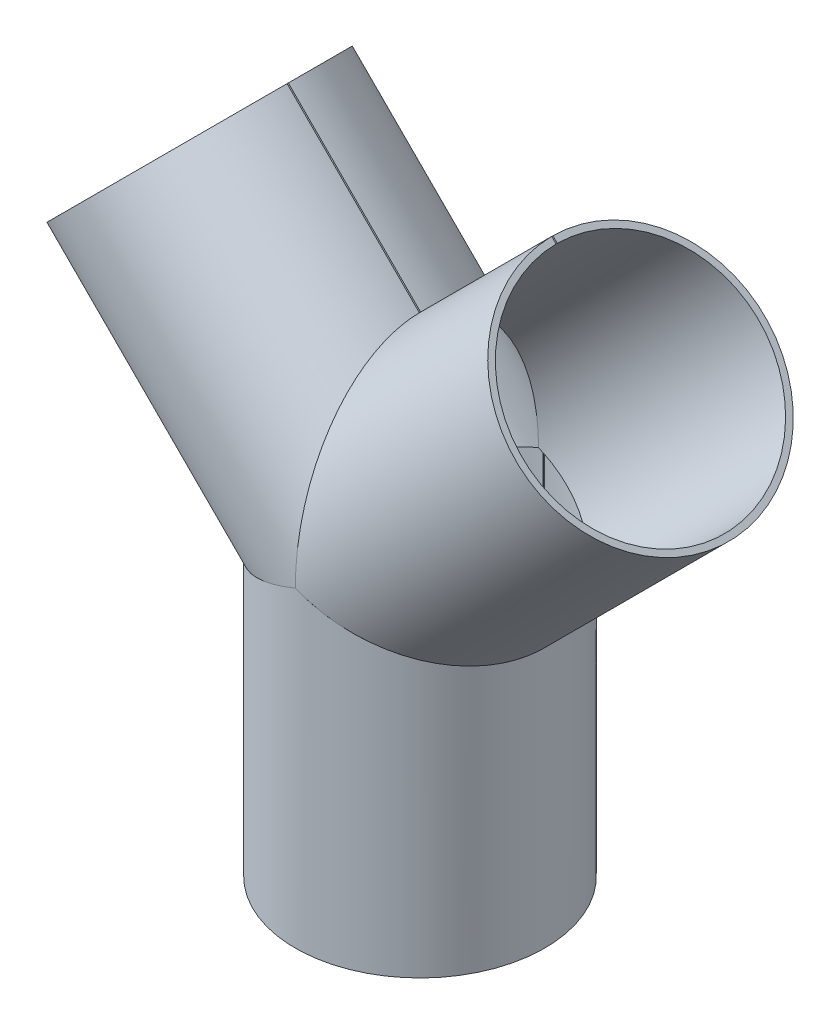
ISO-10303-21;
HEADER;
FILE_DESCRIPTION(('STEP AP214'),'2;1');
FILE_NAME('part.step','',(''),(''),'','','');
FILE_SCHEMA(('AUTOMOTIVE_DESIGN { 1 0 10303 214 1 1 1 1 }'));
ENDSEC;
DATA;
#1=APPLICATION_CONTEXT('core data for automotive mechanical design processes');
#2=APPLICATION_PROTOCOL_DEFINITION('international standard','automotive_design',2000,#1);
#3=PRODUCT_CONTEXT('',#1,'mechanical');
#4=PRODUCT('Part','Part','',(#3));
#5=PRODUCT_RELATED_PRODUCT_CATEGORY('part','',(#4));
#6=PRODUCT_DEFINITION_FORMATION('','',#4);
#7=PRODUCT_DEFINITION_CONTEXT('part definition',#1,'design');
#8=PRODUCT_DEFINITION('design','',#6,#7);
#9=PRODUCT_DEFINITION_SHAPE('','',#8);
#10=(LENGTH_UNIT() NAMED_UNIT(*) SI_UNIT(.MILLI.,.METRE.));
#11=(NAMED_UNIT(*) PLANE_ANGLE_UNIT() SI_UNIT($,.RADIAN.));
#12=(NAMED_UNIT(*) SI_UNIT($,.STERADIAN.) SOLID_ANGLE_UNIT());
#13=UNCERTAINTY_MEASURE_WITH_UNIT(LENGTH_MEASURE(1.E-05),#10,'distance_accuracy_value','');
#14=(GEOMETRIC_REPRESENTATION_CONTEXT(3) GLOBAL_UNCERTAINTY_ASSIGNED_CONTEXT((#13)) GLOBAL_UNIT_ASSIGNED_CONTEXT((#10,
#11,#12)) REPRESENTATION_CONTEXT('',''));
#15=CARTESIAN_POINT('',(0.,0.,0.));
#16=DIRECTION('',(0.,0.,1.));
#17=DIRECTION('',(1.,0.,0.));
#18=AXIS2_PLACEMENT_3D('',#15,#16,#17);
#19=CARTESIAN_POINT('',(0.,0.,0.));
#20=DIRECTION('',(0.,-1.,0.));
#21=DIRECTION('',(1.,0.,0.));
#22=AXIS2_PLACEMENT_3D('',#19,#20,#21);
#23=CYLINDRICAL_SURFACE('',#22,200.);
#24=CARTESIAN_POINT('',(0.,0.,0.));
#25=DIRECTION('',(-0.382683432365084,-0.923879532511289,0.));
#26=DIRECTION('',(0.923879532511289,-0.382683432365084,0.));
#27=AXIS2_PLACEMENT_3D('',#24,#25,#26);
#28=ELLIPSE('',#27,216.478440058478,200.);
#29=CARTESIAN_POINT('',(0.999996874994865,-0.414212267953578,-199.9975));
#30=VERTEX_POINT('',#29);
#31=CARTESIAN_POINT('',(0.,0.,200.));
#32=VERTEX_POINT('',#31);
#33=EDGE_CURVE('E130',#30,#32,#28,.T.);
#34=ORIENTED_EDGE('',*,*,#33,.T.);
#35=CARTESIAN_POINT('',(0.,0.,0.));
#36=DIRECTION('',(0.382683432365084,-0.923879532511289,0.));
#37=DIRECTION('',(-0.923879532511289,-0.382683432365084,0.));
#38=AXIS2_PLACEMENT_3D('',#35,#36,#37);
#39=ELLIPSE('',#38,216.478440058478,200.);
#40=CARTESIAN_POINT('',(-0.999996874995147,-0.414212267953695,-199.9975));
#41=VERTEX_POINT('',#40);
#42=EDGE_CURVE('E133',#32,#41,#39,.T.);
#43=ORIENTED_EDGE('',*,*,#42,.T.);
#44=DIRECTION('',(0.,-1.,0.));
#45=VECTOR('',#44,1.);
#46=CARTESIAN_POINT('',(-0.999996874995147,0.,-199.9975));
#47=LINE('',#46,#45);
#48=CARTESIAN_POINT('',(-0.999996874995055,-500.,-199.9975));
#49=VERTEX_POINT('',#48);
#50=EDGE_CURVE('E97',#41,#49,#47,.T.);
#51=ORIENTED_EDGE('',*,*,#50,.T.);
#52=CARTESIAN_POINT('',(0.,-500.,0.));
#53=DIRECTION('',(0.,1.,0.));
#54=DIRECTION('',(-1.,0.,0.));
#55=AXIS2_PLACEMENT_3D('',#52,#53,#54);
#56=CIRCLE('',#55,200.);
#57=CARTESIAN_POINT('',(0.999996874994957,-500.,-199.9975));
#58=VERTEX_POINT('',#57);
#59=EDGE_CURVE('E146',#49,#58,#56,.T.);
#60=ORIENTED_EDGE('',*,*,#59,.T.);
#61=DIRECTION('',(0.,-1.,0.));
#62=VECTOR('',#61,1.);
#63=CARTESIAN_POINT('',(0.999996874994865,0.,-199.9975));
#64=LINE('',#63,#62);
#65=EDGE_CURVE('E90',#30,#58,#64,.T.);
#66=ORIENTED_EDGE('',*,*,#65,.F.);
#67=EDGE_LOOP('',(#34,#43,#51,#60,#66));
#68=FACE_BOUND('',#67,.T.);
#69=ADVANCED_FACE('F83',(#68),#23,.T.);
#70=CARTESIAN_POINT('',(0.992496898432423,0.,-198.49751875));
#71=DIRECTION('',(-0.9999875,0.,-0.00499998437496119));
#72=DIRECTION('',(-0.00499998437496119,0.,0.9999875));
#73=AXIS2_PLACEMENT_3D('',#70,#71,#72);
#74=PLANE('',#73);
#75=DIRECTION('',(-0.00499997365179152,0.00207105689808014,0.999985355386171));
#76=VECTOR('',#75,1.);
#77=CARTESIAN_POINT('',(0.992492641338627,-0.411103912597948,-198.496667339223));
#78=LINE('',#77,#76);
#79=CARTESIAN_POINT('',(0.992496898432423,-0.411105675943934,-198.49751875));
#80=VERTEX_POINT('',#79);
#81=EDGE_CURVE('E138',#30,#80,#78,.T.);
#82=ORIENTED_EDGE('',*,*,#81,.F.);
#83=ORIENTED_EDGE('',*,*,#65,.T.);
#84=DIRECTION('',(0.00499998437496119,0.,-0.9999875));
#85=VECTOR('',#84,1.);
#86=CARTESIAN_POINT('',(0.992496898432515,-500.,-198.49751875));
#87=LINE('',#86,#85);
#88=CARTESIAN_POINT('',(0.992496898432515,-500.,-198.49751875));
#89=VERTEX_POINT('',#88);
#90=EDGE_CURVE('E149',#89,#58,#87,.T.);
#91=ORIENTED_EDGE('',*,*,#90,.F.);
#92=DIRECTION('',(0.,-1.,0.));
#93=VECTOR('',#92,1.);
#94=CARTESIAN_POINT('',(0.992496898432423,0.,-198.49751875));
#95=LINE('',#94,#93);
#96=EDGE_CURVE('E164',#80,#89,#95,.T.);
#97=ORIENTED_EDGE('',*,*,#96,.F.);
#98=EDGE_LOOP('',(#82,#83,#91,#97));
#99=FACE_BOUND('',#98,.T.);
#100=ADVANCED_FACE('F167',(#99),#74,.T.);
#101=CARTESIAN_POINT('',(0.,0.,0.));
#102=DIRECTION('',(0.,-1.,0.));
#103=DIRECTION('',(1.,0.,0.));
#104=AXIS2_PLACEMENT_3D('',#101,#102,#103);
#105=CYLINDRICAL_SURFACE('',#104,198.5);
#106=CARTESIAN_POINT('',(0.,0.,0.));
#107=DIRECTION('',(-0.382683432365084,-0.923879532511289,0.));
#108=DIRECTION('',(0.923879532511289,-0.382683432365084,0.));
#109=AXIS2_PLACEMENT_3D('',#106,#107,#108);
#110=ELLIPSE('',#109,214.85485175804,198.5);
#111=CARTESIAN_POINT('',(0.,0.,198.5));
#112=VERTEX_POINT('',#111);
#113=EDGE_CURVE('E142',#80,#112,#110,.T.);
#114=ORIENTED_EDGE('',*,*,#113,.F.);
#115=ORIENTED_EDGE('',*,*,#96,.T.);
#116=CARTESIAN_POINT('',(0.,-500.,0.));
#117=DIRECTION('',(0.,1.,0.));
#118=DIRECTION('',(1.,0.,0.));
#119=AXIS2_PLACEMENT_3D('',#116,#117,#118);
#120=CIRCLE('',#119,198.5);
#121=CARTESIAN_POINT('',(-0.992496898432571,-500.,-198.49751875));
#122=VERTEX_POINT('',#121);
#123=EDGE_CURVE('E156',#122,#89,#120,.T.);
#124=ORIENTED_EDGE('',*,*,#123,.F.);
#125=DIRECTION('',(0.,-1.,0.));
#126=VECTOR('',#125,1.);
#127=CARTESIAN_POINT('',(-0.992496898432663,0.,-198.49751875));
#128=LINE('',#127,#126);
#129=CARTESIAN_POINT('',(-0.992496898432663,-0.411105675944034,-198.49751875));
#130=VERTEX_POINT('',#129);
#131=EDGE_CURVE('E105',#130,#122,#128,.T.);
#132=ORIENTED_EDGE('',*,*,#131,.F.);
#133=CARTESIAN_POINT('',(0.,0.,0.));
#134=DIRECTION('',(0.382683432365084,-0.923879532511289,0.));
#135=DIRECTION('',(-0.923879532511289,-0.382683432365084,0.));
#136=AXIS2_PLACEMENT_3D('',#133,#134,#135);
#137=ELLIPSE('',#136,214.85485175804,198.5);
#138=EDGE_CURVE('E147',#112,#130,#137,.T.);
#139=ORIENTED_EDGE('',*,*,#138,.F.);
#140=EDGE_LOOP('',(#114,#115,#124,#132,#139));
#141=FACE_BOUND('',#140,.T.);
#142=ADVANCED_FACE('F172',(#141),#105,.F.);
#143=CARTESIAN_POINT('',(-0.999996874995147,0.,-199.9975));
#144=DIRECTION('',(0.9999875,0.,-0.0049999843749888));
#145=DIRECTION('',(-0.0049999843749888,0.,-0.9999875));
#146=AXIS2_PLACEMENT_3D('',#143,#144,#145);
#147=PLANE('',#146);
#148=DIRECTION('',(-0.00499997365181913,-0.00207105689809158,-0.999985355386171));
#149=VECTOR('',#148,1.);
#150=CARTESIAN_POINT('',(-0.999992585731875,-0.414210491282676,-199.996642155388));
#151=LINE('',#150,#149);
#152=EDGE_CURVE('E137',#130,#41,#151,.T.);
#153=ORIENTED_EDGE('',*,*,#152,.F.);
#154=ORIENTED_EDGE('',*,*,#131,.T.);
#155=DIRECTION('',(0.0049999843749888,0.,0.9999875));
#156=VECTOR('',#155,1.);
#157=CARTESIAN_POINT('',(-0.999996874995055,-500.,-199.9975));
#158=LINE('',#157,#156);
#159=EDGE_CURVE('E159',#49,#122,#158,.T.);
#160=ORIENTED_EDGE('',*,*,#159,.F.);
#161=ORIENTED_EDGE('',*,*,#50,.F.);
#162=EDGE_LOOP('',(#153,#154,#160,#161));
#163=FACE_BOUND('',#162,.T.);
#164=ADVANCED_FACE('F175',(#163),#147,.T.);
#165=CARTESIAN_POINT('',(0.,-500.,0.));
#166=DIRECTION('',(0.,1.,0.));
#167=DIRECTION('',(1.,0.,0.));
#168=AXIS2_PLACEMENT_3D('',#165,#166,#167);
#169=PLANE('',#168);
#170=ORIENTED_EDGE('',*,*,#59,.F.);
#171=ORIENTED_EDGE('',*,*,#159,.T.);
#172=ORIENTED_EDGE('',*,*,#123,.T.);
#173=ORIENTED_EDGE('',*,*,#90,.T.);
#174=EDGE_LOOP('',(#170,#171,#172,#173));
#175=FACE_BOUND('',#174,.T.);
#176=ADVANCED_FACE('F170',(#175),#169,.F.);
#177=CARTESIAN_POINT('',(0.,0.,-200.));
#178=DIRECTION('',(0.382683432365084,-0.923879532511289,0.));
#179=DIRECTION('',(0.923879532511289,0.382683432365084,0.));
#180=AXIS2_PLACEMENT_3D('',#177,#178,#179);
#181=PLANE('',#180);
#182=DIRECTION('',(0.,0.,-1.));
#183=VECTOR('',#182,1.);
#184=CARTESIAN_POINT('',(0.,0.,0.));
#185=LINE('',#184,#183);
#186=EDGE_CURVE('E13',#32,#112,#185,.T.);
#187=ORIENTED_EDGE('',*,*,#186,.T.);
#188=ORIENTED_EDGE('',*,*,#138,.T.);
#189=ORIENTED_EDGE('',*,*,#152,.T.);
#190=ORIENTED_EDGE('',*,*,#42,.F.);
#191=EDGE_LOOP('',(#187,#188,#189,#190));
#192=FACE_BOUND('',#191,.T.);
#193=ADVANCED_FACE('F145',(#192),#181,.F.);
#194=CARTESIAN_POINT('',(0.,0.,-200.));
#195=DIRECTION('',(-0.382683432365084,-0.923879532511289,0.));
#196=DIRECTION('',(0.923879532511289,-0.382683432365084,0.));
#197=AXIS2_PLACEMENT_3D('',#194,#195,#196);
#198=PLANE('',#197);
#199=ORIENTED_EDGE('',*,*,#33,.F.);
#200=ORIENTED_EDGE('',*,*,#81,.T.);
#201=ORIENTED_EDGE('',*,*,#113,.T.);
#202=ORIENTED_EDGE('',*,*,#186,.F.);
#203=EDGE_LOOP('',(#199,#200,#201,#202));
#204=FACE_BOUND('',#203,.T.);
#205=ADVANCED_FACE('F140',(#204),#198,.F.);
#206=CLOSED_SHELL('',(#69,#100,#142,#164,#176,#193,#205));
#207=MANIFOLD_SOLID_BREP('B2',#206);
#208=CARTESIAN_POINT('',(-1.11022302462516E-13,0.,0.));
#209=DIRECTION('',(-0.707106781186549,0.707106781186546,0.));
#210=DIRECTION('',(-0.707106781186546,-0.707106781186549,0.));
#211=AXIS2_PLACEMENT_3D('',#208,#209,#210);
#212=CYLINDRICAL_SURFACE('',#211,200.);
#213=CARTESIAN_POINT('',(0.,0.,0.));
#214=DIRECTION('',(-1.,0.,0.));
#215=DIRECTION('',(0.,1.,0.));
#216=AXIS2_PLACEMENT_3D('',#213,#214,#215);
#217=ELLIPSE('',#216,282.842712474619,200.);
#218=CARTESIAN_POINT('',(0.,282.839176940713,0.9999968749952));
#219=VERTEX_POINT('',#218);
#220=CARTESIAN_POINT('',(0.,0.,200.));
#221=VERTEX_POINT('',#220);
#222=EDGE_CURVE('E321',#219,#221,#217,.F.);
#223=ORIENTED_EDGE('',*,*,#222,.F.);
#224=DIRECTION('',(-0.707106781186549,0.707106781186546,0.));
#225=VECTOR('',#224,1.);
#226=CARTESIAN_POINT('',(141.419588470356,141.419588470357,0.999996874995208));
#227=LINE('',#226,#225);
#228=CARTESIAN_POINT('',(-212.133802122918,494.97297906363,0.999996874995208));
#229=VERTEX_POINT('',#228);
#230=EDGE_CURVE('E336',#219,#229,#227,.T.);
#231=ORIENTED_EDGE('',*,*,#230,.T.);
#232=CARTESIAN_POINT('',(-353.553390593275,353.553390593273,0.));
#233=DIRECTION('',(-0.707106781186549,0.707106781186546,0.));
#234=DIRECTION('',(-0.707106781186546,-0.707106781186549,0.));
#235=AXIS2_PLACEMENT_3D('',#232,#233,#234);
#236=CIRCLE('',#235,200.);
#237=CARTESIAN_POINT('',(-212.133802122918,494.97297906363,-0.99999687499507));
#238=VERTEX_POINT('',#237);
#239=EDGE_CURVE('E323',#238,#229,#236,.T.);
#240=ORIENTED_EDGE('',*,*,#239,.F.);
#241=DIRECTION('',(-0.707106781186549,0.707106781186546,0.));
#242=VECTOR('',#241,1.);
#243=CARTESIAN_POINT('',(141.419588470356,141.419588470357,-0.99999687499507));
#244=LINE('',#243,#242);
#245=CARTESIAN_POINT('',(0.,282.839176940713,-0.999996874995076));
#246=VERTEX_POINT('',#245);
#247=EDGE_CURVE('E258',#246,#238,#244,.T.);
#248=ORIENTED_EDGE('',*,*,#247,.F.);
#249=CARTESIAN_POINT('',(0.,0.,-200.));
#250=VERTEX_POINT('',#249);
#251=EDGE_CURVE('E307',#250,#246,#217,.F.);
#252=ORIENTED_EDGE('',*,*,#251,.F.);
#253=CARTESIAN_POINT('',(0.,0.,0.));
#254=DIRECTION('',(0.382683432365096,-0.923879532511284,0.));
#255=DIRECTION('',(-0.923879532511284,-0.382683432365096,0.));
#256=AXIS2_PLACEMENT_3D('',#253,#254,#255);
#257=ELLIPSE('',#256,216.478440058478,200.);
#258=EDGE_CURVE('E318',#250,#221,#257,.F.);
#259=ORIENTED_EDGE('',*,*,#258,.T.);
#260=EDGE_LOOP('',(#223,#231,#240,#248,#252,#259));
#261=FACE_BOUND('',#260,.T.);
#262=ADVANCED_FACE('F251',(#261),#212,.T.);
#263=CARTESIAN_POINT('',(0.,0.,0.));
#264=DIRECTION('',(-0.707106781186549,0.707106781186546,0.));
#265=DIRECTION('',(-0.707106781186546,-0.707106781186549,0.));
#266=AXIS2_PLACEMENT_3D('',#263,#264,#265);
#267=CYLINDRICAL_SURFACE('',#266,190.);
#268=DIRECTION('',(-0.707106781186549,0.707106781186546,0.));
#269=VECTOR('',#268,1.);
#270=CARTESIAN_POINT('',(134.348609046838,134.348609046839,0.949997031245436));
#271=LINE('',#270,#269);
#272=CARTESIAN_POINT('',(0.,268.697218093677,0.949997031245436));
#273=VERTEX_POINT('',#272);
#274=CARTESIAN_POINT('',(-219.204781546436,487.901999640112,0.949997031245436));
#275=VERTEX_POINT('',#274);
#276=EDGE_CURVE('E339',#273,#275,#271,.T.);
#277=ORIENTED_EDGE('',*,*,#276,.F.);
#278=CARTESIAN_POINT('',(0.,0.,0.));
#279=DIRECTION('',(-1.,0.,0.));
#280=DIRECTION('',(0.,1.,0.));
#281=AXIS2_PLACEMENT_3D('',#278,#279,#280);
#282=ELLIPSE('',#281,268.700576850888,190.);
#283=CARTESIAN_POINT('',(0.,0.,190.));
#284=VERTEX_POINT('',#283);
#285=EDGE_CURVE('E353',#273,#284,#282,.F.);
#286=ORIENTED_EDGE('',*,*,#285,.T.);
#287=CARTESIAN_POINT('',(0.,0.,0.));
#288=DIRECTION('',(0.382683432365096,-0.923879532511284,0.));
#289=DIRECTION('',(-0.923879532511284,-0.382683432365096,0.));
#290=AXIS2_PLACEMENT_3D('',#287,#288,#289);
#291=ELLIPSE('',#290,205.654518055554,190.);
#292=CARTESIAN_POINT('',(0.,0.,-190.));
#293=VERTEX_POINT('',#292);
#294=EDGE_CURVE('E313',#293,#284,#291,.F.);
#295=ORIENTED_EDGE('',*,*,#294,.F.);
#296=CARTESIAN_POINT('',(0.,268.697218093677,-0.949997031245328));
#297=VERTEX_POINT('',#296);
#298=EDGE_CURVE('E308',#293,#297,#282,.F.);
#299=ORIENTED_EDGE('',*,*,#298,.T.);
#300=DIRECTION('',(-0.707106781186549,0.707106781186546,0.));
#301=VECTOR('',#300,1.);
#302=CARTESIAN_POINT('',(134.348609046838,134.348609046839,-0.949997031245328));
#303=LINE('',#302,#301);
#304=CARTESIAN_POINT('',(-219.204781546436,487.901999640112,-0.949997031245328));
#305=VERTEX_POINT('',#304);
#306=EDGE_CURVE('E272',#297,#305,#303,.T.);
#307=ORIENTED_EDGE('',*,*,#306,.T.);
#308=CARTESIAN_POINT('',(-353.553390593274,353.553390593273,0.));
#309=DIRECTION('',(-0.707106781186549,0.707106781186546,0.));
#310=DIRECTION('',(0.,0.,1.));
#311=AXIS2_PLACEMENT_3D('',#308,#309,#310);
#312=CIRCLE('',#311,190.);
#313=EDGE_CURVE('E332',#305,#275,#312,.T.);
#314=ORIENTED_EDGE('',*,*,#313,.T.);
#315=EDGE_LOOP('',(#277,#286,#295,#299,#307,#314));
#316=FACE_BOUND('',#315,.T.);
#317=ADVANCED_FACE('F358',(#316),#267,.F.);
#318=CARTESIAN_POINT('',(141.419588470356,141.419588470357,-0.99999687499507));
#319=DIRECTION('',(-0.00353552285737103,-0.00353552285737104,-0.9999875));
#320=DIRECTION('',(0.,0.999993749941406,-0.00353554495445795));
#321=AXIS2_PLACEMENT_3D('',#318,#319,#320);
#322=PLANE('',#321);
#323=ORIENTED_EDGE('',*,*,#306,.F.);
#324=DIRECTION('',(0.,0.999993749941406,-0.00353554495445795));
#325=VECTOR('',#324,1.);
#326=CARTESIAN_POINT('',(0.,141.421356226261,-0.500004687517184));
#327=LINE('',#326,#325);
#328=EDGE_CURVE('E350',#297,#246,#327,.T.);
#329=ORIENTED_EDGE('',*,*,#328,.T.);
#330=ORIENTED_EDGE('',*,*,#247,.T.);
#331=DIRECTION('',(-0.707097942351781,-0.707097942351784,0.0049999843749742));
#332=VECTOR('',#331,1.);
#333=CARTESIAN_POINT('',(-212.133802122918,494.97297906363,-0.99999687499507));
#334=LINE('',#333,#332);
#335=EDGE_CURVE('E334',#238,#305,#334,.T.);
#336=ORIENTED_EDGE('',*,*,#335,.T.);
#337=EDGE_LOOP('',(#323,#329,#330,#336));
#338=FACE_BOUND('',#337,.T.);
#339=ADVANCED_FACE('F349',(#338),#322,.F.);
#340=CARTESIAN_POINT('',(134.348609046838,134.348609046839,0.949997031245436));
#341=DIRECTION('',(-0.00353552285737315,-0.00353552285737317,0.9999875));
#342=DIRECTION('',(0.,-0.999993749941406,-0.00353554495446008));
#343=AXIS2_PLACEMENT_3D('',#340,#341,#342);
#344=PLANE('',#343);
#345=ORIENTED_EDGE('',*,*,#230,.F.);
#346=DIRECTION('',(0.,-0.999993749941406,-0.00353554495446008));
#347=VECTOR('',#346,1.);
#348=CARTESIAN_POINT('',(0.,134.350288414948,0.475004453141158));
#349=LINE('',#348,#347);
#350=EDGE_CURVE('E356',#219,#273,#349,.T.);
#351=ORIENTED_EDGE('',*,*,#350,.T.);
#352=ORIENTED_EDGE('',*,*,#276,.T.);
#353=DIRECTION('',(0.707097942351781,0.707097942351784,0.0049999843749772));
#354=VECTOR('',#353,1.);
#355=CARTESIAN_POINT('',(-219.204781546436,487.901999640112,0.949997031245436));
#356=LINE('',#355,#354);
#357=EDGE_CURVE('E326',#275,#229,#356,.T.);
#358=ORIENTED_EDGE('',*,*,#357,.T.);
#359=EDGE_LOOP('',(#345,#351,#352,#358));
#360=FACE_BOUND('',#359,.T.);
#361=ADVANCED_FACE('F344',(#360),#344,.F.);
#362=CARTESIAN_POINT('',(-353.553390593275,353.553390593273,0.));
#363=DIRECTION('',(-0.707106781186549,0.707106781186546,0.));
#364=DIRECTION('',(0.,0.,1.));
#365=AXIS2_PLACEMENT_3D('',#362,#363,#364);
#366=PLANE('',#365);
#367=ORIENTED_EDGE('',*,*,#239,.T.);
#368=ORIENTED_EDGE('',*,*,#357,.F.);
#369=ORIENTED_EDGE('',*,*,#313,.F.);
#370=ORIENTED_EDGE('',*,*,#335,.F.);
#371=EDGE_LOOP('',(#367,#368,#369,#370));
#372=FACE_BOUND('',#371,.T.);
#373=ADVANCED_FACE('F348',(#372),#366,.T.);
#374=CARTESIAN_POINT('',(0.,0.,-200.));
#375=DIRECTION('',(0.382683432365096,-0.923879532511284,0.));
#376=DIRECTION('',(0.923879532511284,0.382683432365096,0.));
#377=AXIS2_PLACEMENT_3D('',#374,#375,#376);
#378=PLANE('',#377);
#379=ORIENTED_EDGE('',*,*,#258,.F.);
#380=DIRECTION('',(0.,0.,1.));
#381=VECTOR('',#380,1.);
#382=CARTESIAN_POINT('',(0.,0.,-200.));
#383=LINE('',#382,#381);
#384=EDGE_CURVE('E304',#250,#293,#383,.T.);
#385=ORIENTED_EDGE('',*,*,#384,.T.);
#386=ORIENTED_EDGE('',*,*,#294,.T.);
#387=DIRECTION('',(0.,0.,1.));
#388=VECTOR('',#387,1.);
#389=CARTESIAN_POINT('',(-1.11022302462516E-13,0.,0.));
#390=LINE('',#389,#388);
#391=EDGE_CURVE('E81',#284,#221,#390,.T.);
#392=ORIENTED_EDGE('',*,*,#391,.T.);
#393=EDGE_LOOP('',(#379,#385,#386,#392));
#394=FACE_BOUND('',#393,.T.);
#395=ADVANCED_FACE('F322',(#394),#378,.T.);
#396=CARTESIAN_POINT('',(0.,0.,-200.));
#397=DIRECTION('',(-1.,0.,0.));
#398=DIRECTION('',(0.,0.,1.));
#399=AXIS2_PLACEMENT_3D('',#396,#397,#398);
#400=PLANE('',#399);
#401=ORIENTED_EDGE('',*,*,#251,.T.);
#402=ORIENTED_EDGE('',*,*,#328,.F.);
#403=ORIENTED_EDGE('',*,*,#298,.F.);
#404=ORIENTED_EDGE('',*,*,#384,.F.);
#405=EDGE_LOOP('',(#401,#402,#403,#404));
#406=FACE_BOUND('',#405,.T.);
#407=ADVANCED_FACE('F306',(#406),#400,.F.);
#408=ORIENTED_EDGE('',*,*,#222,.T.);
#409=ORIENTED_EDGE('',*,*,#391,.F.);
#410=ORIENTED_EDGE('',*,*,#285,.F.);
#411=ORIENTED_EDGE('',*,*,#350,.F.);
#412=EDGE_LOOP('',(#408,#409,#410,#411));
#413=FACE_BOUND('',#412,.T.);
#414=ADVANCED_FACE('F359',(#413),#400,.F.);
#415=CLOSED_SHELL('',(#262,#317,#339,#361,#373,#395,#407,#414));
#416=MANIFOLD_SOLID_BREP('B7',#415);
#417=CARTESIAN_POINT('',(0.,0.,0.));
#418=DIRECTION('',(0.707106781186546,0.707106781186549,0.));
#419=DIRECTION('',(-0.707106781186549,0.707106781186546,0.));
#420=AXIS2_PLACEMENT_3D('',#417,#418,#419);
#421=CYLINDRICAL_SURFACE('',#420,200.);
#422=DIRECTION('',(0.707106781186546,0.707106781186549,0.));
#423=VECTOR('',#422,1.);
#424=CARTESIAN_POINT('',(-141.419588470357,141.419588470356,0.999996874995142));
#425=LINE('',#424,#423);
#426=CARTESIAN_POINT('',(0.,282.839176940713,0.999996874995135));
#427=VERTEX_POINT('',#426);
#428=CARTESIAN_POINT('',(212.133802122916,494.972979063631,0.999996874995142));
#429=VERTEX_POINT('',#428);
#430=EDGE_CURVE('E441',#427,#429,#425,.T.);
#431=ORIENTED_EDGE('',*,*,#430,.F.);
#432=CARTESIAN_POINT('',(0.,0.,0.));
#433=DIRECTION('',(-1.,0.,0.));
#434=DIRECTION('',(0.,1.,0.));
#435=AXIS2_PLACEMENT_3D('',#432,#433,#434);
#436=ELLIPSE('',#435,282.84271247462,200.);
#437=CARTESIAN_POINT('',(0.,0.,200.));
#438=VERTEX_POINT('',#437);
#439=EDGE_CURVE('E488',#427,#438,#436,.F.);
#440=ORIENTED_EDGE('',*,*,#439,.T.);
#441=CARTESIAN_POINT('',(0.,0.,0.));
#442=DIRECTION('',(0.382683432365094,0.923879532511285,0.));
#443=DIRECTION('',(0.923879532511285,-0.382683432365094,0.));
#444=AXIS2_PLACEMENT_3D('',#441,#442,#443);
#445=ELLIPSE('',#444,216.478440058478,200.);
#446=CARTESIAN_POINT('',(0.,0.,-200.));
#447=VERTEX_POINT('',#446);
#448=EDGE_CURVE('E497',#447,#438,#445,.F.);
#449=ORIENTED_EDGE('',*,*,#448,.F.);
#450=CARTESIAN_POINT('',(0.,282.839176940713,-0.999996874995052));
#451=VERTEX_POINT('',#450);
#452=EDGE_CURVE('E503',#447,#451,#436,.F.);
#453=ORIENTED_EDGE('',*,*,#452,.T.);
#454=DIRECTION('',(0.707106781186546,0.707106781186549,0.));
#455=VECTOR('',#454,1.);
#456=CARTESIAN_POINT('',(-141.419588470357,141.419588470356,-0.999996874995055));
#457=LINE('',#456,#455);
#458=CARTESIAN_POINT('',(212.133802122916,494.972979063631,-0.999996874995055));
#459=VERTEX_POINT('',#458);
#460=EDGE_CURVE('E520',#451,#459,#457,.T.);
#461=ORIENTED_EDGE('',*,*,#460,.T.);
#462=CARTESIAN_POINT('',(353.553390593273,353.553390593274,0.));
#463=DIRECTION('',(0.707106781186546,0.707106781186549,0.));
#464=DIRECTION('',(-0.707106781186549,0.707106781186546,0.));
#465=AXIS2_PLACEMENT_3D('',#462,#463,#464);
#466=CIRCLE('',#465,200.);
#467=EDGE_CURVE('E505',#429,#459,#466,.T.);
#468=ORIENTED_EDGE('',*,*,#467,.F.);
#469=EDGE_LOOP('',(#431,#440,#449,#453,#461,#468));
#470=FACE_BOUND('',#469,.T.);
#471=ADVANCED_FACE('F434',(#470),#421,.T.);
#472=CARTESIAN_POINT('',(-141.419588470357,141.419588470356,0.999996874995142));
#473=DIRECTION('',(0.00353552285737691,-0.0035355228573769,0.9999875));
#474=DIRECTION('',(0.999993749941406,0.,-0.00353554495446382));
#475=AXIS2_PLACEMENT_3D('',#472,#473,#474);
#476=PLANE('',#475);
#477=DIRECTION('',(0.,-0.999993749941406,-0.00353554495446381));
#478=VECTOR('',#477,1.);
#479=CARTESIAN_POINT('',(0.,141.421356226261,0.500004687516422));
#480=LINE('',#479,#478);
#481=CARTESIAN_POINT('',(0.,268.697218093678,0.949997031245317));
#482=VERTEX_POINT('',#481);
#483=EDGE_CURVE('E501',#427,#482,#480,.T.);
#484=ORIENTED_EDGE('',*,*,#483,.F.);
#485=ORIENTED_EDGE('',*,*,#430,.T.);
#486=DIRECTION('',(0.707097942351784,-0.707097942351782,-0.00499998437498249));
#487=VECTOR('',#486,1.);
#488=CARTESIAN_POINT('',(212.133802122916,494.972979063631,0.999996874995142));
#489=LINE('',#488,#487);
#490=CARTESIAN_POINT('',(219.204781546434,487.901999640113,0.949997031245317));
#491=VERTEX_POINT('',#490);
#492=EDGE_CURVE('E518',#429,#491,#489,.T.);
#493=ORIENTED_EDGE('',*,*,#492,.T.);
#494=DIRECTION('',(0.707106781186546,0.707106781186549,0.));
#495=VECTOR('',#494,1.);
#496=CARTESIAN_POINT('',(-134.348609046839,134.348609046838,0.949997031245317));
#497=LINE('',#496,#495);
#498=EDGE_CURVE('E455',#482,#491,#497,.T.);
#499=ORIENTED_EDGE('',*,*,#498,.F.);
#500=EDGE_LOOP('',(#484,#485,#493,#499));
#501=FACE_BOUND('',#500,.T.);
#502=ADVANCED_FACE('F533',(#501),#476,.F.);
#503=CARTESIAN_POINT('',(0.,0.,0.));
#504=DIRECTION('',(0.707106781186546,0.707106781186549,0.));
#505=DIRECTION('',(-0.707106781186549,0.707106781186546,0.));
#506=AXIS2_PLACEMENT_3D('',#503,#504,#505);
#507=CYLINDRICAL_SURFACE('',#506,190.);
#508=CARTESIAN_POINT('',(0.,0.,0.));
#509=DIRECTION('',(-1.,0.,0.));
#510=DIRECTION('',(0.,1.,0.));
#511=AXIS2_PLACEMENT_3D('',#508,#509,#510);
#512=ELLIPSE('',#511,268.700576850889,190.);
#513=CARTESIAN_POINT('',(0.,0.,190.));
#514=VERTEX_POINT('',#513);
#515=EDGE_CURVE('E489',#482,#514,#512,.F.);
#516=ORIENTED_EDGE('',*,*,#515,.F.);
#517=ORIENTED_EDGE('',*,*,#498,.T.);
#518=CARTESIAN_POINT('',(353.553390593273,353.553390593274,0.));
#519=DIRECTION('',(0.707106781186546,0.707106781186549,0.));
#520=DIRECTION('',(0.707106781186549,-0.707106781186546,0.));
#521=AXIS2_PLACEMENT_3D('',#518,#519,#520);
#522=CIRCLE('',#521,190.);
#523=CARTESIAN_POINT('',(219.204781546434,487.901999640113,-0.949997031245279));
#524=VERTEX_POINT('',#523);
#525=EDGE_CURVE('E516',#491,#524,#522,.T.);
#526=ORIENTED_EDGE('',*,*,#525,.T.);
#527=DIRECTION('',(0.707106781186546,0.707106781186549,0.));
#528=VECTOR('',#527,1.);
#529=CARTESIAN_POINT('',(-134.348609046839,134.348609046838,-0.949997031245279));
#530=LINE('',#529,#528);
#531=CARTESIAN_POINT('',(0.,268.697218093678,-0.949997031245279));
#532=VERTEX_POINT('',#531);
#533=EDGE_CURVE('E523',#532,#524,#530,.T.);
#534=ORIENTED_EDGE('',*,*,#533,.F.);
#535=CARTESIAN_POINT('',(0.,0.,-190.));
#536=VERTEX_POINT('',#535);
#537=EDGE_CURVE('E536',#536,#532,#512,.F.);
#538=ORIENTED_EDGE('',*,*,#537,.F.);
#539=CARTESIAN_POINT('',(0.,0.,0.));
#540=DIRECTION('',(0.382683432365094,0.923879532511285,0.));
#541=DIRECTION('',(0.923879532511285,-0.382683432365094,0.));
#542=AXIS2_PLACEMENT_3D('',#539,#540,#541);
#543=ELLIPSE('',#542,205.654518055554,190.);
#544=EDGE_CURVE('E506',#536,#514,#543,.F.);
#545=ORIENTED_EDGE('',*,*,#544,.T.);
#546=EDGE_LOOP('',(#516,#517,#526,#534,#538,#545));
#547=FACE_BOUND('',#546,.T.);
#548=ADVANCED_FACE('F540',(#547),#507,.F.);
#549=CARTESIAN_POINT('',(-134.348609046839,134.348609046838,-0.949997031245279));
#550=DIRECTION('',(0.00353552285737346,-0.00353552285737345,-0.9999875));
#551=DIRECTION('',(-0.999993749941406,0.,-0.00353554495446037));
#552=AXIS2_PLACEMENT_3D('',#549,#550,#551);
#553=PLANE('',#552);
#554=DIRECTION('',(0.,0.999993749941406,-0.00353554495446036));
#555=VECTOR('',#554,1.);
#556=CARTESIAN_POINT('',(0.,134.350288414948,-0.475004453140958));
#557=LINE('',#556,#555);
#558=EDGE_CURVE('E541',#532,#451,#557,.T.);
#559=ORIENTED_EDGE('',*,*,#558,.F.);
#560=ORIENTED_EDGE('',*,*,#533,.T.);
#561=DIRECTION('',(-0.707097942351784,0.707097942351782,-0.00499998437497761));
#562=VECTOR('',#561,1.);
#563=CARTESIAN_POINT('',(219.204781546434,487.901999640113,-0.949997031245279));
#564=LINE('',#563,#562);
#565=EDGE_CURVE('E509',#524,#459,#564,.T.);
#566=ORIENTED_EDGE('',*,*,#565,.T.);
#567=ORIENTED_EDGE('',*,*,#460,.F.);
#568=EDGE_LOOP('',(#559,#560,#566,#567));
#569=FACE_BOUND('',#568,.T.);
#570=ADVANCED_FACE('F528',(#569),#553,.F.);
#571=CARTESIAN_POINT('',(353.553390593273,353.553390593274,0.));
#572=DIRECTION('',(0.707106781186546,0.707106781186549,0.));
#573=DIRECTION('',(0.707106781186549,-0.707106781186546,0.));
#574=AXIS2_PLACEMENT_3D('',#571,#572,#573);
#575=PLANE('',#574);
#576=ORIENTED_EDGE('',*,*,#467,.T.);
#577=ORIENTED_EDGE('',*,*,#565,.F.);
#578=ORIENTED_EDGE('',*,*,#525,.F.);
#579=ORIENTED_EDGE('',*,*,#492,.F.);
#580=EDGE_LOOP('',(#576,#577,#578,#579));
#581=FACE_BOUND('',#580,.T.);
#582=ADVANCED_FACE('F532',(#581),#575,.T.);
#583=CARTESIAN_POINT('',(0.,0.,-200.));
#584=DIRECTION('',(0.382683432365094,0.923879532511285,0.));
#585=DIRECTION('',(-0.923879532511285,0.382683432365094,0.));
#586=AXIS2_PLACEMENT_3D('',#583,#584,#585);
#587=PLANE('',#586);
#588=ORIENTED_EDGE('',*,*,#448,.T.);
#589=DIRECTION('',(0.,0.,1.));
#590=VECTOR('',#589,1.);
#591=CARTESIAN_POINT('',(0.,0.,0.));
#592=LINE('',#591,#590);
#593=EDGE_CURVE('E249',#514,#438,#592,.T.);
#594=ORIENTED_EDGE('',*,*,#593,.F.);
#595=ORIENTED_EDGE('',*,*,#544,.F.);
#596=DIRECTION('',(0.,0.,1.));
#597=VECTOR('',#596,1.);
#598=CARTESIAN_POINT('',(0.,0.,-200.));
#599=LINE('',#598,#597);
#600=EDGE_CURVE('E500',#447,#536,#599,.T.);
#601=ORIENTED_EDGE('',*,*,#600,.F.);
#602=EDGE_LOOP('',(#588,#594,#595,#601));
#603=FACE_BOUND('',#602,.T.);
#604=ADVANCED_FACE('F504',(#603),#587,.F.);
#605=CARTESIAN_POINT('',(0.,0.,-200.));
#606=DIRECTION('',(-1.,0.,0.));
#607=DIRECTION('',(0.,0.,1.));
#608=AXIS2_PLACEMENT_3D('',#605,#606,#607);
#609=PLANE('',#608);
#610=ORIENTED_EDGE('',*,*,#600,.T.);
#611=ORIENTED_EDGE('',*,*,#537,.T.);
#612=ORIENTED_EDGE('',*,*,#558,.T.);
#613=ORIENTED_EDGE('',*,*,#452,.F.);
#614=EDGE_LOOP('',(#610,#611,#612,#613));
#615=FACE_BOUND('',#614,.T.);
#616=ADVANCED_FACE('F539',(#615),#609,.T.);
#617=ORIENTED_EDGE('',*,*,#483,.T.);
#618=ORIENTED_EDGE('',*,*,#515,.T.);
#619=ORIENTED_EDGE('',*,*,#593,.T.);
#620=ORIENTED_EDGE('',*,*,#439,.F.);
#621=EDGE_LOOP('',(#617,#618,#619,#620));
#622=FACE_BOUND('',#621,.T.);
#623=ADVANCED_FACE('F487',(#622),#609,.T.);
#624=CLOSED_SHELL('',(#471,#502,#548,#570,#582,#604,#616,#623));
#625=MANIFOLD_SOLID_BREP('B75',#624);
#626=ADVANCED_BREP_SHAPE_REPRESENTATION('',(#18,#207,#416,#625),#14);
#627=SHAPE_DEFINITION_REPRESENTATION(#9,#626);
ENDSEC;
END-ISO-10303-21;
